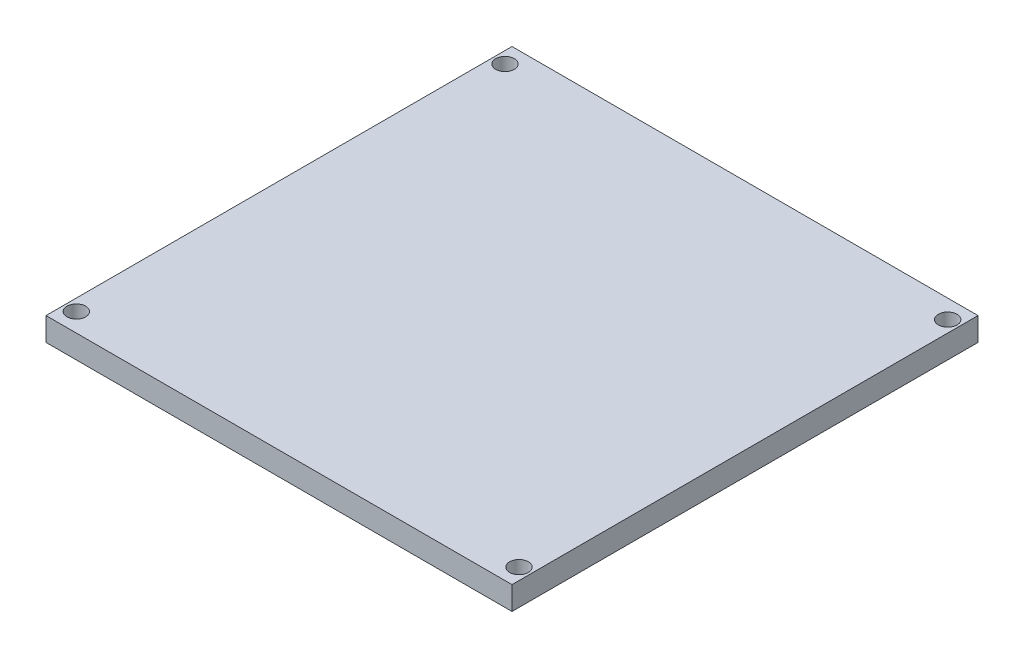
ISO-10303-21;
HEADER;
FILE_DESCRIPTION(('STEP AP214'),'2;1');
FILE_NAME('part.step','',(''),(''),'','','');
FILE_SCHEMA(('AUTOMOTIVE_DESIGN { 1 0 10303 214 1 1 1 1 }'));
ENDSEC;
DATA;
#1=APPLICATION_CONTEXT('core data for automotive mechanical design processes');
#2=APPLICATION_PROTOCOL_DEFINITION('international standard','automotive_design',2000,#1);
#3=PRODUCT_CONTEXT('',#1,'mechanical');
#4=PRODUCT('Part','Part','',(#3));
#5=PRODUCT_RELATED_PRODUCT_CATEGORY('part','',(#4));
#6=PRODUCT_DEFINITION_FORMATION('','',#4);
#7=PRODUCT_DEFINITION_CONTEXT('part definition',#1,'design');
#8=PRODUCT_DEFINITION('design','',#6,#7);
#9=PRODUCT_DEFINITION_SHAPE('','',#8);
#10=(LENGTH_UNIT() NAMED_UNIT(*) SI_UNIT(.MILLI.,.METRE.));
#11=(NAMED_UNIT(*) PLANE_ANGLE_UNIT() SI_UNIT($,.RADIAN.));
#12=(NAMED_UNIT(*) SI_UNIT($,.STERADIAN.) SOLID_ANGLE_UNIT());
#13=UNCERTAINTY_MEASURE_WITH_UNIT(LENGTH_MEASURE(1.E-05),#10,'distance_accuracy_value','');
#14=(GEOMETRIC_REPRESENTATION_CONTEXT(3) GLOBAL_UNCERTAINTY_ASSIGNED_CONTEXT((#13)) GLOBAL_UNIT_ASSIGNED_CONTEXT((#10,
#11,#12)) REPRESENTATION_CONTEXT('',''));
#15=CARTESIAN_POINT('',(0.,0.,0.));
#16=DIRECTION('',(0.,0.,1.));
#17=DIRECTION('',(1.,0.,0.));
#18=AXIS2_PLACEMENT_3D('',#15,#16,#17);
#19=CARTESIAN_POINT('',(-50.,5.,50.));
#20=DIRECTION('',(1.,0.,0.));
#21=DIRECTION('',(0.,0.,-1.));
#22=AXIS2_PLACEMENT_3D('',#19,#20,#21);
#23=PLANE('',#22);
#24=DIRECTION('',(0.,0.,1.));
#25=VECTOR('',#24,1.);
#26=CARTESIAN_POINT('',(-50.,0.,50.));
#27=LINE('',#26,#25);
#28=CARTESIAN_POINT('',(-50.,0.,-50.));
#29=VERTEX_POINT('',#28);
#30=CARTESIAN_POINT('',(-50.,0.,50.));
#31=VERTEX_POINT('',#30);
#32=EDGE_CURVE('E96',#29,#31,#27,.T.);
#33=ORIENTED_EDGE('',*,*,#32,.T.);
#34=DIRECTION('',(0.,-1.,0.));
#35=VECTOR('',#34,1.);
#36=CARTESIAN_POINT('',(-50.,5.,50.));
#37=LINE('',#36,#35);
#38=CARTESIAN_POINT('',(-50.,5.,50.));
#39=VERTEX_POINT('',#38);
#40=EDGE_CURVE('E11',#39,#31,#37,.T.);
#41=ORIENTED_EDGE('',*,*,#40,.F.);
#42=DIRECTION('',(0.,0.,1.));
#43=VECTOR('',#42,1.);
#44=CARTESIAN_POINT('',(-50.,5.,50.));
#45=LINE('',#44,#43);
#46=CARTESIAN_POINT('',(-50.,5.,-50.));
#47=VERTEX_POINT('',#46);
#48=EDGE_CURVE('E84',#47,#39,#45,.T.);
#49=ORIENTED_EDGE('',*,*,#48,.F.);
#50=DIRECTION('',(0.,-1.,0.));
#51=VECTOR('',#50,1.);
#52=CARTESIAN_POINT('',(-50.,5.,-50.));
#53=LINE('',#52,#51);
#54=EDGE_CURVE('E92',#47,#29,#53,.T.);
#55=ORIENTED_EDGE('',*,*,#54,.T.);
#56=EDGE_LOOP('',(#33,#41,#49,#55));
#57=FACE_BOUND('',#56,.T.);
#58=ADVANCED_FACE('F33',(#57),#23,.F.);
#59=CARTESIAN_POINT('',(50.,5.,50.));
#60=DIRECTION('',(0.,0.,-1.));
#61=DIRECTION('',(-1.,0.,0.));
#62=AXIS2_PLACEMENT_3D('',#59,#60,#61);
#63=PLANE('',#62);
#64=DIRECTION('',(1.,0.,0.));
#65=VECTOR('',#64,1.);
#66=CARTESIAN_POINT('',(50.,0.,50.));
#67=LINE('',#66,#65);
#68=CARTESIAN_POINT('',(50.,0.,50.));
#69=VERTEX_POINT('',#68);
#70=EDGE_CURVE('E88',#31,#69,#67,.T.);
#71=ORIENTED_EDGE('',*,*,#70,.T.);
#72=DIRECTION('',(0.,-1.,0.));
#73=VECTOR('',#72,1.);
#74=CARTESIAN_POINT('',(50.,5.,50.));
#75=LINE('',#74,#73);
#76=CARTESIAN_POINT('',(50.,5.,50.));
#77=VERTEX_POINT('',#76);
#78=EDGE_CURVE('E41',#77,#69,#75,.T.);
#79=ORIENTED_EDGE('',*,*,#78,.F.);
#80=DIRECTION('',(1.,0.,0.));
#81=VECTOR('',#80,1.);
#82=CARTESIAN_POINT('',(50.,5.,50.));
#83=LINE('',#82,#81);
#84=EDGE_CURVE('E79',#39,#77,#83,.T.);
#85=ORIENTED_EDGE('',*,*,#84,.F.);
#86=ORIENTED_EDGE('',*,*,#40,.T.);
#87=EDGE_LOOP('',(#71,#79,#85,#86));
#88=FACE_BOUND('',#87,.T.);
#89=ADVANCED_FACE('F87',(#88),#63,.F.);
#90=CARTESIAN_POINT('',(50.,5.,50.));
#91=DIRECTION('',(-1.,0.,0.));
#92=DIRECTION('',(0.,0.,1.));
#93=AXIS2_PLACEMENT_3D('',#90,#91,#92);
#94=PLANE('',#93);
#95=DIRECTION('',(0.,0.,-1.));
#96=VECTOR('',#95,1.);
#97=CARTESIAN_POINT('',(50.,0.,50.));
#98=LINE('',#97,#96);
#99=CARTESIAN_POINT('',(50.,0.,-50.));
#100=VERTEX_POINT('',#99);
#101=EDGE_CURVE('E66',#69,#100,#98,.T.);
#102=ORIENTED_EDGE('',*,*,#101,.T.);
#103=DIRECTION('',(0.,-1.,0.));
#104=VECTOR('',#103,1.);
#105=CARTESIAN_POINT('',(50.,5.,-50.));
#106=LINE('',#105,#104);
#107=CARTESIAN_POINT('',(50.,5.,-50.));
#108=VERTEX_POINT('',#107);
#109=EDGE_CURVE('E89',#108,#100,#106,.T.);
#110=ORIENTED_EDGE('',*,*,#109,.F.);
#111=DIRECTION('',(0.,0.,-1.));
#112=VECTOR('',#111,1.);
#113=CARTESIAN_POINT('',(50.,5.,50.));
#114=LINE('',#113,#112);
#115=EDGE_CURVE('E82',#77,#108,#114,.T.);
#116=ORIENTED_EDGE('',*,*,#115,.F.);
#117=ORIENTED_EDGE('',*,*,#78,.T.);
#118=EDGE_LOOP('',(#102,#110,#116,#117));
#119=FACE_BOUND('',#118,.T.);
#120=ADVANCED_FACE('F90',(#119),#94,.F.);
#121=CARTESIAN_POINT('',(50.,5.,-50.));
#122=DIRECTION('',(0.,0.,1.));
#123=DIRECTION('',(1.,0.,0.));
#124=AXIS2_PLACEMENT_3D('',#121,#122,#123);
#125=PLANE('',#124);
#126=DIRECTION('',(-1.,0.,0.));
#127=VECTOR('',#126,1.);
#128=CARTESIAN_POINT('',(50.,0.,-50.));
#129=LINE('',#128,#127);
#130=EDGE_CURVE('E72',#100,#29,#129,.T.);
#131=ORIENTED_EDGE('',*,*,#130,.T.);
#132=ORIENTED_EDGE('',*,*,#54,.F.);
#133=DIRECTION('',(-1.,0.,0.));
#134=VECTOR('',#133,1.);
#135=CARTESIAN_POINT('',(50.,5.,-50.));
#136=LINE('',#135,#134);
#137=EDGE_CURVE('E49',#108,#47,#136,.T.);
#138=ORIENTED_EDGE('',*,*,#137,.F.);
#139=ORIENTED_EDGE('',*,*,#109,.T.);
#140=EDGE_LOOP('',(#131,#132,#138,#139));
#141=FACE_BOUND('',#140,.T.);
#142=ADVANCED_FACE('F104',(#141),#125,.F.);
#143=CARTESIAN_POINT('',(0.,5.,0.));
#144=DIRECTION('',(0.,1.,0.));
#145=DIRECTION('',(0.,0.,1.));
#146=AXIS2_PLACEMENT_3D('',#143,#144,#145);
#147=PLANE('',#146);
#148=CARTESIAN_POINT('',(-47.5,5.,-46.));
#149=DIRECTION('',(0.,1.,0.));
#150=DIRECTION('',(0.,0.,1.));
#151=AXIS2_PLACEMENT_3D('',#148,#149,#150);
#152=CIRCLE('',#151,1.99999999999999);
#153=CARTESIAN_POINT('',(-47.5,5.,-44.));
#154=VERTEX_POINT('',#153);
#155=EDGE_CURVE('E130',#154,#154,#152,.T.);
#156=ORIENTED_EDGE('',*,*,#155,.F.);
#157=EDGE_LOOP('',(#156));
#158=FACE_BOUND('',#157,.T.);
#159=CARTESIAN_POINT('',(47.5,5.,-46.));
#160=DIRECTION('',(0.,1.,0.));
#161=DIRECTION('',(0.,0.,1.));
#162=AXIS2_PLACEMENT_3D('',#159,#160,#161);
#163=CIRCLE('',#162,1.99999999999999);
#164=CARTESIAN_POINT('',(47.5,5.,-44.));
#165=VERTEX_POINT('',#164);
#166=EDGE_CURVE('E124',#165,#165,#163,.T.);
#167=ORIENTED_EDGE('',*,*,#166,.F.);
#168=EDGE_LOOP('',(#167));
#169=FACE_BOUND('',#168,.T.);
#170=CARTESIAN_POINT('',(47.5,5.,46.));
#171=DIRECTION('',(0.,1.,0.));
#172=DIRECTION('',(0.,0.,1.));
#173=AXIS2_PLACEMENT_3D('',#170,#171,#172);
#174=CIRCLE('',#173,1.99999999999999);
#175=CARTESIAN_POINT('',(47.5,5.,48.));
#176=VERTEX_POINT('',#175);
#177=EDGE_CURVE('E118',#176,#176,#174,.T.);
#178=ORIENTED_EDGE('',*,*,#177,.F.);
#179=EDGE_LOOP('',(#178));
#180=FACE_BOUND('',#179,.T.);
#181=CARTESIAN_POINT('',(-47.5,5.,46.));
#182=DIRECTION('',(0.,1.,0.));
#183=DIRECTION('',(0.,0.,1.));
#184=AXIS2_PLACEMENT_3D('',#181,#182,#183);
#185=CIRCLE('',#184,1.99999999999999);
#186=CARTESIAN_POINT('',(-47.5,5.,48.));
#187=VERTEX_POINT('',#186);
#188=EDGE_CURVE('E112',#187,#187,#185,.T.);
#189=ORIENTED_EDGE('',*,*,#188,.F.);
#190=EDGE_LOOP('',(#189));
#191=FACE_BOUND('',#190,.T.);
#192=ORIENTED_EDGE('',*,*,#48,.T.);
#193=ORIENTED_EDGE('',*,*,#84,.T.);
#194=ORIENTED_EDGE('',*,*,#115,.T.);
#195=ORIENTED_EDGE('',*,*,#137,.T.);
#196=EDGE_LOOP('',(#192,#193,#194,#195));
#197=FACE_BOUND('',#196,.T.);
#198=ADVANCED_FACE('F80',(#158,#169,#180,#191,#197),#147,.T.);
#199=CARTESIAN_POINT('',(0.,0.,0.));
#200=DIRECTION('',(0.,1.,0.));
#201=DIRECTION('',(0.,0.,1.));
#202=AXIS2_PLACEMENT_3D('',#199,#200,#201);
#203=PLANE('',#202);
#204=CARTESIAN_POINT('',(-47.5,0.,-46.));
#205=DIRECTION('',(0.,1.,0.));
#206=DIRECTION('',(0.,0.,1.));
#207=AXIS2_PLACEMENT_3D('',#204,#205,#206);
#208=CIRCLE('',#207,1.99999999999999);
#209=CARTESIAN_POINT('',(-47.5,0.,-44.));
#210=VERTEX_POINT('',#209);
#211=EDGE_CURVE('E127',#210,#210,#208,.T.);
#212=ORIENTED_EDGE('',*,*,#211,.T.);
#213=EDGE_LOOP('',(#212));
#214=FACE_BOUND('',#213,.T.);
#215=CARTESIAN_POINT('',(47.5,0.,-46.));
#216=DIRECTION('',(0.,1.,0.));
#217=DIRECTION('',(0.,0.,1.));
#218=AXIS2_PLACEMENT_3D('',#215,#216,#217);
#219=CIRCLE('',#218,1.99999999999999);
#220=CARTESIAN_POINT('',(47.5,0.,-44.));
#221=VERTEX_POINT('',#220);
#222=EDGE_CURVE('E121',#221,#221,#219,.T.);
#223=ORIENTED_EDGE('',*,*,#222,.T.);
#224=EDGE_LOOP('',(#223));
#225=FACE_BOUND('',#224,.T.);
#226=CARTESIAN_POINT('',(47.5,0.,46.));
#227=DIRECTION('',(0.,1.,0.));
#228=DIRECTION('',(0.,0.,1.));
#229=AXIS2_PLACEMENT_3D('',#226,#227,#228);
#230=CIRCLE('',#229,1.99999999999999);
#231=CARTESIAN_POINT('',(47.5,0.,48.));
#232=VERTEX_POINT('',#231);
#233=EDGE_CURVE('E115',#232,#232,#230,.T.);
#234=ORIENTED_EDGE('',*,*,#233,.T.);
#235=EDGE_LOOP('',(#234));
#236=FACE_BOUND('',#235,.T.);
#237=CARTESIAN_POINT('',(-47.5,0.,46.));
#238=DIRECTION('',(0.,1.,0.));
#239=DIRECTION('',(0.,0.,1.));
#240=AXIS2_PLACEMENT_3D('',#237,#238,#239);
#241=CIRCLE('',#240,1.99999999999999);
#242=CARTESIAN_POINT('',(-47.5,0.,48.));
#243=VERTEX_POINT('',#242);
#244=EDGE_CURVE('E99',#243,#243,#241,.T.);
#245=ORIENTED_EDGE('',*,*,#244,.T.);
#246=EDGE_LOOP('',(#245));
#247=FACE_BOUND('',#246,.T.);
#248=ORIENTED_EDGE('',*,*,#32,.F.);
#249=ORIENTED_EDGE('',*,*,#130,.F.);
#250=ORIENTED_EDGE('',*,*,#101,.F.);
#251=ORIENTED_EDGE('',*,*,#70,.F.);
#252=EDGE_LOOP('',(#248,#249,#250,#251));
#253=FACE_BOUND('',#252,.T.);
#254=ADVANCED_FACE('F107',(#214,#225,#236,#247,#253),#203,.F.);
#255=CARTESIAN_POINT('',(-47.5,5.,46.));
#256=DIRECTION('',(0.,1.,0.));
#257=DIRECTION('',(0.,0.,1.));
#258=AXIS2_PLACEMENT_3D('',#255,#256,#257);
#259=CYLINDRICAL_SURFACE('',#258,1.99999999999999);
#260=ORIENTED_EDGE('',*,*,#244,.F.);
#261=EDGE_LOOP('',(#260));
#262=FACE_BOUND('',#261,.T.);
#263=ORIENTED_EDGE('',*,*,#188,.T.);
#264=EDGE_LOOP('',(#263));
#265=FACE_BOUND('',#264,.T.);
#266=ADVANCED_FACE('F145',(#262,#265),#259,.F.);
#267=CARTESIAN_POINT('',(47.5,5.,46.));
#268=DIRECTION('',(0.,1.,0.));
#269=DIRECTION('',(0.,0.,1.));
#270=AXIS2_PLACEMENT_3D('',#267,#268,#269);
#271=CYLINDRICAL_SURFACE('',#270,1.99999999999999);
#272=ORIENTED_EDGE('',*,*,#233,.F.);
#273=EDGE_LOOP('',(#272));
#274=FACE_BOUND('',#273,.T.);
#275=ORIENTED_EDGE('',*,*,#177,.T.);
#276=EDGE_LOOP('',(#275));
#277=FACE_BOUND('',#276,.T.);
#278=ADVANCED_FACE('F147',(#274,#277),#271,.F.);
#279=CARTESIAN_POINT('',(47.5,5.,-46.));
#280=DIRECTION('',(0.,1.,0.));
#281=DIRECTION('',(0.,0.,1.));
#282=AXIS2_PLACEMENT_3D('',#279,#280,#281);
#283=CYLINDRICAL_SURFACE('',#282,1.99999999999999);
#284=ORIENTED_EDGE('',*,*,#222,.F.);
#285=EDGE_LOOP('',(#284));
#286=FACE_BOUND('',#285,.T.);
#287=ORIENTED_EDGE('',*,*,#166,.T.);
#288=EDGE_LOOP('',(#287));
#289=FACE_BOUND('',#288,.T.);
#290=ADVANCED_FACE('F154',(#286,#289),#283,.F.);
#291=CARTESIAN_POINT('',(-47.5,5.,-46.));
#292=DIRECTION('',(0.,1.,0.));
#293=DIRECTION('',(0.,0.,1.));
#294=AXIS2_PLACEMENT_3D('',#291,#292,#293);
#295=CYLINDRICAL_SURFACE('',#294,1.99999999999999);
#296=ORIENTED_EDGE('',*,*,#211,.F.);
#297=EDGE_LOOP('',(#296));
#298=FACE_BOUND('',#297,.T.);
#299=ORIENTED_EDGE('',*,*,#155,.T.);
#300=EDGE_LOOP('',(#299));
#301=FACE_BOUND('',#300,.T.);
#302=ADVANCED_FACE('F134',(#298,#301),#295,.F.);
#303=CLOSED_SHELL('',(#58,#89,#120,#142,#198,#254,#266,#278,#290,#302));
#304=MANIFOLD_SOLID_BREP('B2',#303);
#305=ADVANCED_BREP_SHAPE_REPRESENTATION('',(#18,#304),#14);
#306=SHAPE_DEFINITION_REPRESENTATION(#9,#305);
ENDSEC;
END-ISO-10303-21;
